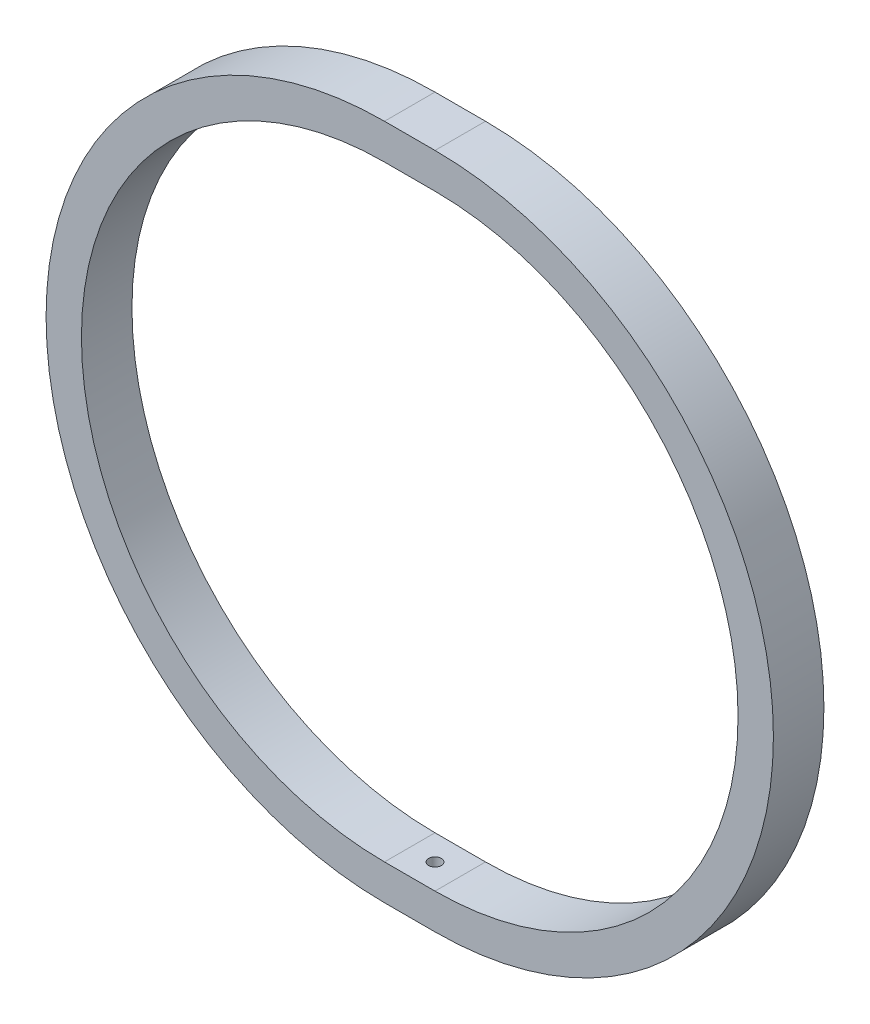
ISO-10303-21;
HEADER;
FILE_DESCRIPTION(('STEP AP214'),'2;1');
FILE_NAME('part.step','',(''),(''),'','','');
FILE_SCHEMA(('AUTOMOTIVE_DESIGN { 1 0 10303 214 1 1 1 1 }'));
ENDSEC;
DATA;
#1=APPLICATION_CONTEXT('core data for automotive mechanical design processes');
#2=APPLICATION_PROTOCOL_DEFINITION('international standard','automotive_design',2000,#1);
#3=PRODUCT_CONTEXT('',#1,'mechanical');
#4=PRODUCT('Part','Part','',(#3));
#5=PRODUCT_RELATED_PRODUCT_CATEGORY('part','',(#4));
#6=PRODUCT_DEFINITION_FORMATION('','',#4);
#7=PRODUCT_DEFINITION_CONTEXT('part definition',#1,'design');
#8=PRODUCT_DEFINITION('design','',#6,#7);
#9=PRODUCT_DEFINITION_SHAPE('','',#8);
#10=(LENGTH_UNIT() NAMED_UNIT(*) SI_UNIT(.MILLI.,.METRE.));
#11=(NAMED_UNIT(*) PLANE_ANGLE_UNIT() SI_UNIT($,.RADIAN.));
#12=(NAMED_UNIT(*) SI_UNIT($,.STERADIAN.) SOLID_ANGLE_UNIT());
#13=UNCERTAINTY_MEASURE_WITH_UNIT(LENGTH_MEASURE(1.E-05),#10,'distance_accuracy_value','');
#14=(GEOMETRIC_REPRESENTATION_CONTEXT(3) GLOBAL_UNCERTAINTY_ASSIGNED_CONTEXT((#13)) GLOBAL_UNIT_ASSIGNED_CONTEXT((#10,
#11,#12)) REPRESENTATION_CONTEXT('',''));
#15=CARTESIAN_POINT('',(0.,0.,0.));
#16=DIRECTION('',(0.,0.,1.));
#17=DIRECTION('',(1.,0.,0.));
#18=AXIS2_PLACEMENT_3D('',#15,#16,#17);
#19=CARTESIAN_POINT('',(9.99999999999958,60.0000000000001,5.00000000000001));
#20=DIRECTION('',(0.,1.,0.));
#21=DIRECTION('',(-1.,0.,0.));
#22=AXIS2_PLACEMENT_3D('',#19,#20,#21);
#23=PLANE('',#22);
#24=DIRECTION('',(0.,0.,-1.));
#25=VECTOR('',#24,1.);
#26=CARTESIAN_POINT('',(0.,60.,5.00000000000001));
#27=LINE('',#26,#25);
#28=CARTESIAN_POINT('',(0.,60.,5.00000000000001));
#29=VERTEX_POINT('',#28);
#30=CARTESIAN_POINT('',(0.,60.,-4.99999999999999));
#31=VERTEX_POINT('',#30);
#32=EDGE_CURVE('E110',#29,#31,#27,.T.);
#33=ORIENTED_EDGE('',*,*,#32,.T.);
#34=DIRECTION('',(-1.,0.,0.));
#35=VECTOR('',#34,1.);
#36=CARTESIAN_POINT('',(9.99999999999958,60.0000000000001,-4.99999999999999));
#37=LINE('',#36,#35);
#38=CARTESIAN_POINT('',(9.99999999999958,60.0000000000001,-4.99999999999999));
#39=VERTEX_POINT('',#38);
#40=EDGE_CURVE('E134',#39,#31,#37,.T.);
#41=ORIENTED_EDGE('',*,*,#40,.F.);
#42=DIRECTION('',(0.,0.,-1.));
#43=VECTOR('',#42,1.);
#44=CARTESIAN_POINT('',(9.99999999999958,60.0000000000001,5.00000000000001));
#45=LINE('',#44,#43);
#46=CARTESIAN_POINT('',(9.99999999999958,60.0000000000001,5.00000000000001));
#47=VERTEX_POINT('',#46);
#48=EDGE_CURVE('E124',#47,#39,#45,.T.);
#49=ORIENTED_EDGE('',*,*,#48,.F.);
#50=DIRECTION('',(-1.,0.,0.));
#51=VECTOR('',#50,1.);
#52=CARTESIAN_POINT('',(9.99999999999958,60.0000000000001,5.00000000000001));
#53=LINE('',#52,#51);
#54=EDGE_CURVE('E111',#47,#29,#53,.T.);
#55=ORIENTED_EDGE('',*,*,#54,.T.);
#56=EDGE_LOOP('',(#33,#41,#49,#55));
#57=FACE_BOUND('',#56,.T.);
#58=CARTESIAN_POINT('',(5.00000000000042,60.,0.));
#59=DIRECTION('',(0.,1.,0.));
#60=DIRECTION('',(-1.,0.,0.));
#61=AXIS2_PLACEMENT_3D('',#58,#59,#60);
#62=CIRCLE('',#61,1.25);
#63=CARTESIAN_POINT('',(3.75000000000042,60.,0.));
#64=VERTEX_POINT('',#63);
#65=EDGE_CURVE('E191',#64,#64,#62,.T.);
#66=ORIENTED_EDGE('',*,*,#65,.T.);
#67=EDGE_LOOP('',(#66));
#68=FACE_BOUND('',#67,.T.);
#69=ADVANCED_FACE('F35',(#57,#68),#23,.F.);
#70=CARTESIAN_POINT('',(4.6785849940498E-13,-67.,5.00000000000001));
#71=DIRECTION('',(0.,0.,1.));
#72=DIRECTION('',(1.,0.,0.));
#73=AXIS2_PLACEMENT_3D('',#70,#71,#72);
#74=PLANE('',#73);
#75=ORIENTED_EDGE('',*,*,#54,.F.);
#76=CARTESIAN_POINT('',(10.,0.,5.00000000000001));
#77=DIRECTION('',(0.,0.,1.));
#78=DIRECTION('',(1.,0.,0.));
#79=AXIS2_PLACEMENT_3D('',#76,#77,#78);
#80=CIRCLE('',#79,60.);
#81=CARTESIAN_POINT('',(10.0000000000004,-59.9999999999999,5.00000000000001));
#82=VERTEX_POINT('',#81);
#83=EDGE_CURVE('E120',#82,#47,#80,.T.);
#84=ORIENTED_EDGE('',*,*,#83,.F.);
#85=DIRECTION('',(-1.,0.,0.));
#86=VECTOR('',#85,1.);
#87=CARTESIAN_POINT('',(10.0000000000004,-59.9999999999999,5.00000000000001));
#88=LINE('',#87,#86);
#89=CARTESIAN_POINT('',(4.18977760661176E-13,-60.,5.00000000000001));
#90=VERTEX_POINT('',#89);
#91=EDGE_CURVE('E125',#82,#90,#88,.T.);
#92=ORIENTED_EDGE('',*,*,#91,.T.);
#93=CARTESIAN_POINT('',(0.,0.,5.00000000000001));
#94=DIRECTION('',(0.,0.,-1.));
#95=DIRECTION('',(-1.,0.,0.));
#96=AXIS2_PLACEMENT_3D('',#93,#94,#95);
#97=CIRCLE('',#96,60.);
#98=EDGE_CURVE('E11',#90,#29,#97,.T.);
#99=ORIENTED_EDGE('',*,*,#98,.T.);
#100=EDGE_LOOP('',(#75,#84,#92,#99));
#101=FACE_BOUND('',#100,.T.);
#102=CARTESIAN_POINT('',(10.,0.,5.00000000000001));
#103=DIRECTION('',(0.,0.,1.));
#104=DIRECTION('',(1.,0.,0.));
#105=AXIS2_PLACEMENT_3D('',#102,#103,#104);
#106=CIRCLE('',#105,67.);
#107=CARTESIAN_POINT('',(10.0000000000005,-66.9999999999999,5.00000000000001));
#108=VERTEX_POINT('',#107);
#109=CARTESIAN_POINT('',(9.99999999999953,67.0000000000001,5.00000000000001));
#110=VERTEX_POINT('',#109);
#111=EDGE_CURVE('E114',#108,#110,#106,.T.);
#112=ORIENTED_EDGE('',*,*,#111,.T.);
#113=DIRECTION('',(-1.,0.,0.));
#114=VECTOR('',#113,1.);
#115=CARTESIAN_POINT('',(9.99999999999953,67.0000000000001,5.00000000000001));
#116=LINE('',#115,#114);
#117=CARTESIAN_POINT('',(0.,67.,5.00000000000001));
#118=VERTEX_POINT('',#117);
#119=EDGE_CURVE('E101',#110,#118,#116,.T.);
#120=ORIENTED_EDGE('',*,*,#119,.T.);
#121=CARTESIAN_POINT('',(0.,0.,5.00000000000001));
#122=DIRECTION('',(0.,0.,-1.));
#123=DIRECTION('',(-1.,0.,0.));
#124=AXIS2_PLACEMENT_3D('',#121,#122,#123);
#125=CIRCLE('',#124,67.);
#126=CARTESIAN_POINT('',(4.6785849940498E-13,-67.,5.00000000000001));
#127=VERTEX_POINT('',#126);
#128=EDGE_CURVE('E58',#127,#118,#125,.T.);
#129=ORIENTED_EDGE('',*,*,#128,.F.);
#130=DIRECTION('',(-1.,0.,0.));
#131=VECTOR('',#130,1.);
#132=CARTESIAN_POINT('',(10.0000000000005,-66.9999999999999,5.00000000000001));
#133=LINE('',#132,#131);
#134=EDGE_CURVE('E116',#108,#127,#133,.T.);
#135=ORIENTED_EDGE('',*,*,#134,.F.);
#136=EDGE_LOOP('',(#112,#120,#129,#135));
#137=FACE_BOUND('',#136,.T.);
#138=ADVANCED_FACE('F115',(#101,#137),#74,.T.);
#139=CARTESIAN_POINT('',(0.,0.,29.8743832473673));
#140=DIRECTION('',(0.,0.,-1.));
#141=DIRECTION('',(-1.,0.,0.));
#142=AXIS2_PLACEMENT_3D('',#139,#140,#141);
#143=CYLINDRICAL_SURFACE('',#142,60.);
#144=CARTESIAN_POINT('',(0.,0.,-4.99999999999999));
#145=DIRECTION('',(0.,0.,-1.));
#146=DIRECTION('',(-1.,0.,0.));
#147=AXIS2_PLACEMENT_3D('',#144,#145,#146);
#148=CIRCLE('',#147,60.);
#149=CARTESIAN_POINT('',(4.18977760661176E-13,-60.,-4.99999999999999));
#150=VERTEX_POINT('',#149);
#151=EDGE_CURVE('E43',#150,#31,#148,.T.);
#152=ORIENTED_EDGE('',*,*,#151,.T.);
#153=ORIENTED_EDGE('',*,*,#32,.F.);
#154=ORIENTED_EDGE('',*,*,#98,.F.);
#155=DIRECTION('',(0.,0.,-1.));
#156=VECTOR('',#155,1.);
#157=CARTESIAN_POINT('',(4.18977760661176E-13,-60.,5.00000000000001));
#158=LINE('',#157,#156);
#159=EDGE_CURVE('E142',#90,#150,#158,.T.);
#160=ORIENTED_EDGE('',*,*,#159,.T.);
#161=EDGE_LOOP('',(#152,#153,#154,#160));
#162=FACE_BOUND('',#161,.T.);
#163=ADVANCED_FACE('F37',(#162),#143,.F.);
#164=CARTESIAN_POINT('',(4.6785849940498E-13,-67.,-4.99999999999999));
#165=DIRECTION('',(0.,0.,-1.));
#166=DIRECTION('',(-1.,0.,0.));
#167=AXIS2_PLACEMENT_3D('',#164,#165,#166);
#168=PLANE('',#167);
#169=DIRECTION('',(-1.,0.,0.));
#170=VECTOR('',#169,1.);
#171=CARTESIAN_POINT('',(9.99999999999953,67.0000000000001,-4.99999999999999));
#172=LINE('',#171,#170);
#173=CARTESIAN_POINT('',(9.99999999999953,67.0000000000001,-4.99999999999999));
#174=VERTEX_POINT('',#173);
#175=CARTESIAN_POINT('',(-4.6785849940498E-13,67.,-4.99999999999999));
#176=VERTEX_POINT('',#175);
#177=EDGE_CURVE('E128',#174,#176,#172,.T.);
#178=ORIENTED_EDGE('',*,*,#177,.F.);
#179=CARTESIAN_POINT('',(10.,0.,-4.99999999999999));
#180=DIRECTION('',(0.,0.,1.));
#181=DIRECTION('',(1.,0.,0.));
#182=AXIS2_PLACEMENT_3D('',#179,#180,#181);
#183=CIRCLE('',#182,67.);
#184=CARTESIAN_POINT('',(10.,-66.9999999999999,-4.99999999999999));
#185=VERTEX_POINT('',#184);
#186=EDGE_CURVE('E121',#185,#174,#183,.T.);
#187=ORIENTED_EDGE('',*,*,#186,.F.);
#188=DIRECTION('',(-1.,0.,0.));
#189=VECTOR('',#188,1.);
#190=CARTESIAN_POINT('',(10.0000000000005,-66.9999999999999,-4.99999999999999));
#191=LINE('',#190,#189);
#192=CARTESIAN_POINT('',(4.6785849940498E-13,-67.,-4.99999999999999));
#193=VERTEX_POINT('',#192);
#194=EDGE_CURVE('E50',#185,#193,#191,.T.);
#195=ORIENTED_EDGE('',*,*,#194,.T.);
#196=CARTESIAN_POINT('',(0.,0.,-4.99999999999999));
#197=DIRECTION('',(0.,0.,-1.));
#198=DIRECTION('',(-1.,0.,0.));
#199=AXIS2_PLACEMENT_3D('',#196,#197,#198);
#200=CIRCLE('',#199,67.);
#201=EDGE_CURVE('E148',#193,#176,#200,.T.);
#202=ORIENTED_EDGE('',*,*,#201,.T.);
#203=EDGE_LOOP('',(#178,#187,#195,#202));
#204=FACE_BOUND('',#203,.T.);
#205=CARTESIAN_POINT('',(10.,0.,-4.99999999999999));
#206=DIRECTION('',(0.,0.,1.));
#207=DIRECTION('',(1.,0.,0.));
#208=AXIS2_PLACEMENT_3D('',#205,#206,#207);
#209=CIRCLE('',#208,60.);
#210=CARTESIAN_POINT('',(10.0000000000004,-59.9999999999999,-4.99999999999999));
#211=VERTEX_POINT('',#210);
#212=EDGE_CURVE('E161',#211,#39,#209,.T.);
#213=ORIENTED_EDGE('',*,*,#212,.T.);
#214=ORIENTED_EDGE('',*,*,#40,.T.);
#215=ORIENTED_EDGE('',*,*,#151,.F.);
#216=DIRECTION('',(-1.,0.,0.));
#217=VECTOR('',#216,1.);
#218=CARTESIAN_POINT('',(10.0000000000004,-59.9999999999999,-4.99999999999999));
#219=LINE('',#218,#217);
#220=EDGE_CURVE('E162',#211,#150,#219,.T.);
#221=ORIENTED_EDGE('',*,*,#220,.F.);
#222=EDGE_LOOP('',(#213,#214,#215,#221));
#223=FACE_BOUND('',#222,.T.);
#224=ADVANCED_FACE('F159',(#204,#223),#168,.T.);
#225=CARTESIAN_POINT('',(0.,0.,29.8743832473673));
#226=DIRECTION('',(0.,0.,-1.));
#227=DIRECTION('',(-1.,0.,0.));
#228=AXIS2_PLACEMENT_3D('',#225,#226,#227);
#229=CYLINDRICAL_SURFACE('',#228,67.);
#230=DIRECTION('',(0.,0.,1.));
#231=VECTOR('',#230,1.);
#232=CARTESIAN_POINT('',(4.6785849940498E-13,-67.,5.00000000000001));
#233=LINE('',#232,#231);
#234=EDGE_CURVE('E145',#193,#127,#233,.T.);
#235=ORIENTED_EDGE('',*,*,#234,.T.);
#236=ORIENTED_EDGE('',*,*,#128,.T.);
#237=DIRECTION('',(0.,0.,1.));
#238=VECTOR('',#237,1.);
#239=CARTESIAN_POINT('',(0.,67.,5.00000000000001));
#240=LINE('',#239,#238);
#241=EDGE_CURVE('E108',#176,#118,#240,.T.);
#242=ORIENTED_EDGE('',*,*,#241,.F.);
#243=ORIENTED_EDGE('',*,*,#201,.F.);
#244=EDGE_LOOP('',(#235,#236,#242,#243));
#245=FACE_BOUND('',#244,.T.);
#246=ADVANCED_FACE('F182',(#245),#229,.T.);
#247=CARTESIAN_POINT('',(9.99999999999953,67.0000000000001,-4.99999999999999));
#248=DIRECTION('',(0.,-1.,0.));
#249=DIRECTION('',(1.,0.,0.));
#250=AXIS2_PLACEMENT_3D('',#247,#248,#249);
#251=PLANE('',#250);
#252=ORIENTED_EDGE('',*,*,#241,.T.);
#253=ORIENTED_EDGE('',*,*,#119,.F.);
#254=DIRECTION('',(0.,0.,1.));
#255=VECTOR('',#254,1.);
#256=CARTESIAN_POINT('',(9.99999999999953,67.0000000000001,-4.99999999999999));
#257=LINE('',#256,#255);
#258=EDGE_CURVE('E106',#174,#110,#257,.T.);
#259=ORIENTED_EDGE('',*,*,#258,.F.);
#260=ORIENTED_EDGE('',*,*,#177,.T.);
#261=EDGE_LOOP('',(#252,#253,#259,#260));
#262=FACE_BOUND('',#261,.T.);
#263=ADVANCED_FACE('F103',(#262),#251,.F.);
#264=CARTESIAN_POINT('',(10.0000000000004,-59.9999999999999,-4.99999999999999));
#265=DIRECTION('',(0.,-1.,0.));
#266=DIRECTION('',(1.,0.,0.));
#267=AXIS2_PLACEMENT_3D('',#264,#265,#266);
#268=PLANE('',#267);
#269=CARTESIAN_POINT('',(5.00000000000042,-60.,0.));
#270=DIRECTION('',(0.,1.,0.));
#271=DIRECTION('',(-1.,0.,0.));
#272=AXIS2_PLACEMENT_3D('',#269,#270,#271);
#273=CIRCLE('',#272,1.25);
#274=CARTESIAN_POINT('',(3.75000000000042,-60.,0.));
#275=VERTEX_POINT('',#274);
#276=EDGE_CURVE('E185',#275,#275,#273,.T.);
#277=ORIENTED_EDGE('',*,*,#276,.F.);
#278=EDGE_LOOP('',(#277));
#279=FACE_BOUND('',#278,.T.);
#280=ORIENTED_EDGE('',*,*,#159,.F.);
#281=ORIENTED_EDGE('',*,*,#91,.F.);
#282=DIRECTION('',(0.,0.,1.));
#283=VECTOR('',#282,1.);
#284=CARTESIAN_POINT('',(10.0000000000004,-59.9999999999999,-4.99999999999999));
#285=LINE('',#284,#283);
#286=EDGE_CURVE('E166',#211,#82,#285,.T.);
#287=ORIENTED_EDGE('',*,*,#286,.F.);
#288=ORIENTED_EDGE('',*,*,#220,.T.);
#289=EDGE_LOOP('',(#280,#281,#287,#288));
#290=FACE_BOUND('',#289,.T.);
#291=ADVANCED_FACE('F216',(#279,#290),#268,.F.);
#292=CARTESIAN_POINT('',(10.0000000000005,-66.9999999999999,5.00000000000001));
#293=DIRECTION('',(0.,1.,0.));
#294=DIRECTION('',(-1.,0.,0.));
#295=AXIS2_PLACEMENT_3D('',#292,#293,#294);
#296=PLANE('',#295);
#297=ORIENTED_EDGE('',*,*,#234,.F.);
#298=ORIENTED_EDGE('',*,*,#194,.F.);
#299=DIRECTION('',(0.,0.,-1.));
#300=VECTOR('',#299,1.);
#301=CARTESIAN_POINT('',(10.0000000000005,-66.9999999999999,5.00000000000001));
#302=LINE('',#301,#300);
#303=EDGE_CURVE('E176',#108,#185,#302,.T.);
#304=ORIENTED_EDGE('',*,*,#303,.F.);
#305=ORIENTED_EDGE('',*,*,#134,.T.);
#306=EDGE_LOOP('',(#297,#298,#304,#305));
#307=FACE_BOUND('',#306,.T.);
#308=ADVANCED_FACE('F180',(#307),#296,.F.);
#309=CARTESIAN_POINT('',(10.,0.,23.3476552485724));
#310=DIRECTION('',(0.,0.,1.));
#311=DIRECTION('',(1.,0.,0.));
#312=AXIS2_PLACEMENT_3D('',#309,#310,#311);
#313=CYLINDRICAL_SURFACE('',#312,60.);
#314=ORIENTED_EDGE('',*,*,#83,.T.);
#315=ORIENTED_EDGE('',*,*,#48,.T.);
#316=ORIENTED_EDGE('',*,*,#212,.F.);
#317=ORIENTED_EDGE('',*,*,#286,.T.);
#318=EDGE_LOOP('',(#314,#315,#316,#317));
#319=FACE_BOUND('',#318,.T.);
#320=ADVANCED_FACE('F169',(#319),#313,.F.);
#321=CARTESIAN_POINT('',(10.,0.,23.3476552485724));
#322=DIRECTION('',(0.,0.,1.));
#323=DIRECTION('',(1.,0.,0.));
#324=AXIS2_PLACEMENT_3D('',#321,#322,#323);
#325=CYLINDRICAL_SURFACE('',#324,67.);
#326=ORIENTED_EDGE('',*,*,#303,.T.);
#327=ORIENTED_EDGE('',*,*,#186,.T.);
#328=ORIENTED_EDGE('',*,*,#258,.T.);
#329=ORIENTED_EDGE('',*,*,#111,.F.);
#330=EDGE_LOOP('',(#326,#327,#328,#329));
#331=FACE_BOUND('',#330,.T.);
#332=ADVANCED_FACE('F123',(#331),#325,.T.);
#333=CARTESIAN_POINT('',(5.00000000000044,-62.5,0.));
#334=DIRECTION('',(0.,1.,0.));
#335=DIRECTION('',(-1.,0.,0.));
#336=AXIS2_PLACEMENT_3D('',#333,#334,#335);
#337=CYLINDRICAL_SURFACE('',#336,1.25);
#338=CARTESIAN_POINT('',(5.00000000000044,-62.5,0.));
#339=DIRECTION('',(0.,1.,0.));
#340=DIRECTION('',(-1.,0.,0.));
#341=AXIS2_PLACEMENT_3D('',#338,#339,#340);
#342=CIRCLE('',#341,1.25);
#343=CARTESIAN_POINT('',(3.75000000000044,-62.5,0.));
#344=VERTEX_POINT('',#343);
#345=EDGE_CURVE('E183',#344,#344,#342,.T.);
#346=ORIENTED_EDGE('',*,*,#345,.F.);
#347=EDGE_LOOP('',(#346));
#348=FACE_BOUND('',#347,.T.);
#349=ORIENTED_EDGE('',*,*,#276,.T.);
#350=EDGE_LOOP('',(#349));
#351=FACE_BOUND('',#350,.T.);
#352=ADVANCED_FACE('F272',(#348,#351),#337,.F.);
#353=CARTESIAN_POINT('',(5.00000000000044,-62.5,0.));
#354=DIRECTION('',(0.,1.,0.));
#355=DIRECTION('',(-1.,0.,0.));
#356=AXIS2_PLACEMENT_3D('',#353,#354,#355);
#357=PLANE('',#356);
#358=ORIENTED_EDGE('',*,*,#345,.T.);
#359=EDGE_LOOP('',(#358));
#360=FACE_BOUND('',#359,.T.);
#361=ADVANCED_FACE('F206',(#360),#357,.T.);
#362=CARTESIAN_POINT('',(5.00000000000044,62.5,0.));
#363=DIRECTION('',(0.,-1.,0.));
#364=DIRECTION('',(1.,0.,0.));
#365=AXIS2_PLACEMENT_3D('',#362,#363,#364);
#366=CYLINDRICAL_SURFACE('',#365,1.25);
#367=CARTESIAN_POINT('',(5.00000000000044,62.5,0.));
#368=DIRECTION('',(0.,1.,0.));
#369=DIRECTION('',(-1.,0.,0.));
#370=AXIS2_PLACEMENT_3D('',#367,#368,#369);
#371=CIRCLE('',#370,1.25);
#372=CARTESIAN_POINT('',(3.75000000000044,62.5,0.));
#373=VERTEX_POINT('',#372);
#374=EDGE_CURVE('E189',#373,#373,#371,.T.);
#375=ORIENTED_EDGE('',*,*,#374,.T.);
#376=EDGE_LOOP('',(#375));
#377=FACE_BOUND('',#376,.T.);
#378=ORIENTED_EDGE('',*,*,#65,.F.);
#379=EDGE_LOOP('',(#378));
#380=FACE_BOUND('',#379,.T.);
#381=ADVANCED_FACE('F197',(#377,#380),#366,.F.);
#382=CARTESIAN_POINT('',(5.00000000000044,62.5,0.));
#383=DIRECTION('',(0.,-1.,0.));
#384=DIRECTION('',(-1.,0.,0.));
#385=AXIS2_PLACEMENT_3D('',#382,#383,#384);
#386=PLANE('',#385);
#387=ORIENTED_EDGE('',*,*,#374,.F.);
#388=EDGE_LOOP('',(#387));
#389=FACE_BOUND('',#388,.T.);
#390=ADVANCED_FACE('F200',(#389),#386,.T.);
#391=CLOSED_SHELL('',(#69,#138,#163,#224,#246,#263,#291,#308,#320,#332,#352,#361,#381,#390));
#392=MANIFOLD_SOLID_BREP('B2',#391);
#393=ADVANCED_BREP_SHAPE_REPRESENTATION('',(#18,#392),#14);
#394=SHAPE_DEFINITION_REPRESENTATION(#9,#393);
ENDSEC;
END-ISO-10303-21;
